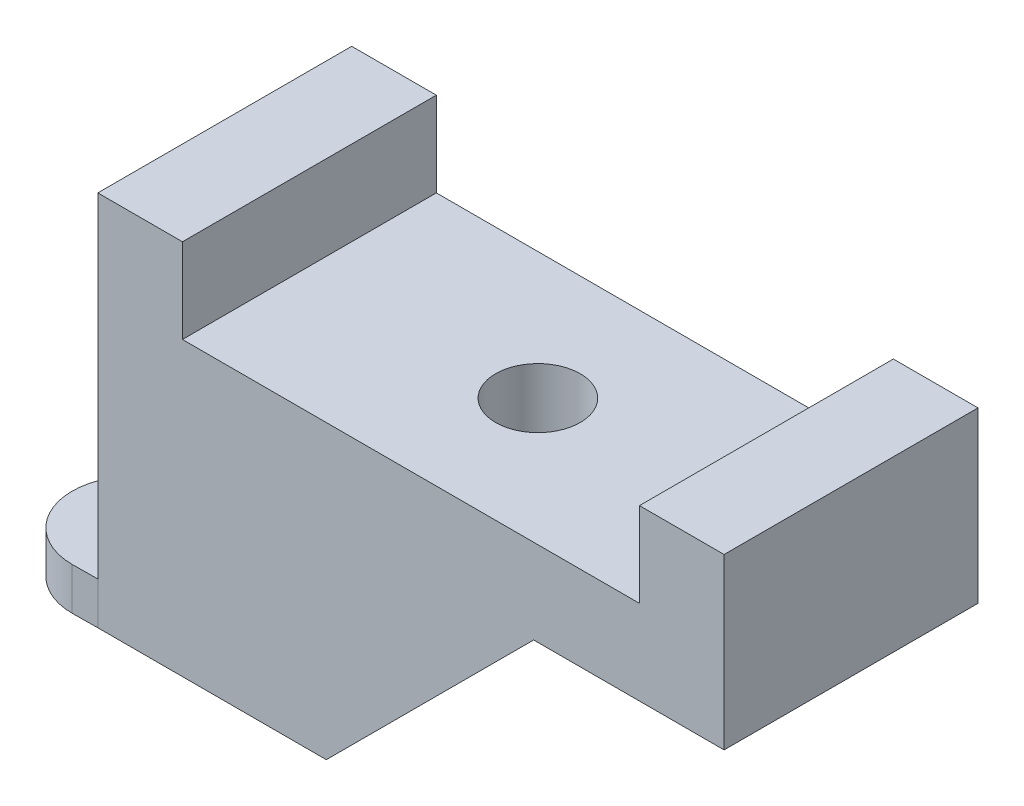
ISO-10303-21;
HEADER;
FILE_DESCRIPTION(('STEP AP214'),'2;1');
FILE_NAME('part.step','',(''),(''),'','','');
FILE_SCHEMA(('AUTOMOTIVE_DESIGN { 1 0 10303 214 1 1 1 1 }'));
ENDSEC;
DATA;
#1=APPLICATION_CONTEXT('core data for automotive mechanical design processes');
#2=APPLICATION_PROTOCOL_DEFINITION('international standard','automotive_design',2000,#1);
#3=PRODUCT_CONTEXT('',#1,'mechanical');
#4=PRODUCT('Part','Part','',(#3));
#5=PRODUCT_RELATED_PRODUCT_CATEGORY('part','',(#4));
#6=PRODUCT_DEFINITION_FORMATION('','',#4);
#7=PRODUCT_DEFINITION_CONTEXT('part definition',#1,'design');
#8=PRODUCT_DEFINITION('design','',#6,#7);
#9=PRODUCT_DEFINITION_SHAPE('','',#8);
#10=(LENGTH_UNIT() NAMED_UNIT(*) SI_UNIT(.MILLI.,.METRE.));
#11=(NAMED_UNIT(*) PLANE_ANGLE_UNIT() SI_UNIT($,.RADIAN.));
#12=(NAMED_UNIT(*) SI_UNIT($,.STERADIAN.) SOLID_ANGLE_UNIT());
#13=UNCERTAINTY_MEASURE_WITH_UNIT(LENGTH_MEASURE(1.E-05),#10,'distance_accuracy_value','');
#14=(GEOMETRIC_REPRESENTATION_CONTEXT(3) GLOBAL_UNCERTAINTY_ASSIGNED_CONTEXT((#13)) GLOBAL_UNIT_ASSIGNED_CONTEXT((#10,
#11,#12)) REPRESENTATION_CONTEXT('',''));
#15=CARTESIAN_POINT('',(0.,0.,0.));
#16=DIRECTION('',(0.,0.,1.));
#17=DIRECTION('',(1.,0.,0.));
#18=AXIS2_PLACEMENT_3D('',#15,#16,#17);
#19=CARTESIAN_POINT('',(-11.1,3.,-4.5));
#20=DIRECTION('',(1.,0.,0.));
#21=DIRECTION('',(0.,0.,-1.));
#22=AXIS2_PLACEMENT_3D('',#19,#20,#21);
#23=PLANE('',#22);
#24=DIRECTION('',(0.,-1.,0.));
#25=VECTOR('',#24,1.);
#26=CARTESIAN_POINT('',(-11.1,3.,-4.5));
#27=LINE('',#26,#25);
#28=CARTESIAN_POINT('',(-11.1,6.,-4.5));
#29=VERTEX_POINT('',#28);
#30=CARTESIAN_POINT('',(-11.1,-2.85,-4.5));
#31=VERTEX_POINT('',#30);
#32=EDGE_CURVE('E168',#29,#31,#27,.T.);
#33=ORIENTED_EDGE('',*,*,#32,.T.);
#34=DIRECTION('',(0.,0.707106781186547,-0.707106781186548));
#35=VECTOR('',#34,1.);
#36=CARTESIAN_POINT('',(-11.1,-2.85,-4.5));
#37=LINE('',#36,#35);
#38=CARTESIAN_POINT('',(-11.1,-7.35,0.));
#39=VERTEX_POINT('',#38);
#40=EDGE_CURVE('E60',#31,#39,#37,.F.);
#41=ORIENTED_EDGE('',*,*,#40,.T.);
#42=DIRECTION('',(0.,-1.,0.));
#43=VECTOR('',#42,1.);
#44=CARTESIAN_POINT('',(-11.1,-5.85,0.));
#45=LINE('',#44,#43);
#46=CARTESIAN_POINT('',(-11.1,-5.85,0.));
#47=VERTEX_POINT('',#46);
#48=EDGE_CURVE('E236',#47,#39,#45,.T.);
#49=ORIENTED_EDGE('',*,*,#48,.F.);
#50=DIRECTION('',(0.,0.,-1.));
#51=VECTOR('',#50,1.);
#52=CARTESIAN_POINT('',(-11.1,-5.85,0.));
#53=LINE('',#52,#51);
#54=CARTESIAN_POINT('',(-11.1,-5.85,4.5));
#55=VERTEX_POINT('',#54);
#56=EDGE_CURVE('E260',#55,#47,#53,.T.);
#57=ORIENTED_EDGE('',*,*,#56,.F.);
#58=DIRECTION('',(0.,-1.,0.));
#59=VECTOR('',#58,1.);
#60=CARTESIAN_POINT('',(-11.1,3.,4.5));
#61=LINE('',#60,#59);
#62=CARTESIAN_POINT('',(-11.1,6.,4.5));
#63=VERTEX_POINT('',#62);
#64=EDGE_CURVE('E171',#63,#55,#61,.T.);
#65=ORIENTED_EDGE('',*,*,#64,.F.);
#66=DIRECTION('',(0.,0.,1.));
#67=VECTOR('',#66,1.);
#68=CARTESIAN_POINT('',(-11.1,6.,-4.5));
#69=LINE('',#68,#67);
#70=EDGE_CURVE('E202',#29,#63,#69,.T.);
#71=ORIENTED_EDGE('',*,*,#70,.F.);
#72=EDGE_LOOP('',(#33,#41,#49,#57,#65,#71));
#73=FACE_BOUND('',#72,.T.);
#74=ADVANCED_FACE('F37',(#73),#23,.F.);
#75=CARTESIAN_POINT('',(0.,0.,0.));
#76=DIRECTION('',(0.,1.,0.));
#77=DIRECTION('',(0.,0.,1.));
#78=AXIS2_PLACEMENT_3D('',#75,#76,#77);
#79=PLANE('',#78);
#80=DIRECTION('',(1.,0.,0.));
#81=VECTOR('',#80,1.);
#82=CARTESIAN_POINT('',(-11.1,0.,4.5));
#83=LINE('',#82,#81);
#84=CARTESIAN_POINT('',(4.34999999999998,0.,4.5));
#85=VERTEX_POINT('',#84);
#86=CARTESIAN_POINT('',(11.1,0.,4.5));
#87=VERTEX_POINT('',#86);
#88=EDGE_CURVE('E178',#85,#87,#83,.T.);
#89=ORIENTED_EDGE('',*,*,#88,.F.);
#90=DIRECTION('',(0.,0.,-1.));
#91=VECTOR('',#90,1.);
#92=CARTESIAN_POINT('',(4.34999999999998,0.,-4.5));
#93=LINE('',#92,#91);
#94=CARTESIAN_POINT('',(4.34999999999998,0.,-4.5));
#95=VERTEX_POINT('',#94);
#96=EDGE_CURVE('E163',#85,#95,#93,.T.);
#97=ORIENTED_EDGE('',*,*,#96,.T.);
#98=DIRECTION('',(-1.,0.,0.));
#99=VECTOR('',#98,1.);
#100=CARTESIAN_POINT('',(-11.1,0.,-4.5));
#101=LINE('',#100,#99);
#102=CARTESIAN_POINT('',(11.1,0.,-4.5));
#103=VERTEX_POINT('',#102);
#104=EDGE_CURVE('E181',#103,#95,#101,.T.);
#105=ORIENTED_EDGE('',*,*,#104,.F.);
#106=DIRECTION('',(0.,0.,-1.));
#107=VECTOR('',#106,1.);
#108=CARTESIAN_POINT('',(11.1,0.,-4.5));
#109=LINE('',#108,#107);
#110=EDGE_CURVE('E184',#87,#103,#109,.T.);
#111=ORIENTED_EDGE('',*,*,#110,.F.);
#112=EDGE_LOOP('',(#89,#97,#105,#111));
#113=FACE_BOUND('',#112,.T.);
#114=ADVANCED_FACE('F282',(#113),#79,.F.);
#115=CARTESIAN_POINT('',(0.,3.,0.));
#116=DIRECTION('',(0.,1.,0.));
#117=DIRECTION('',(0.,0.,1.));
#118=AXIS2_PLACEMENT_3D('',#115,#116,#117);
#119=PLANE('',#118);
#120=CARTESIAN_POINT('',(0.,3.,0.));
#121=DIRECTION('',(0.,1.,0.));
#122=DIRECTION('',(0.,0.,1.));
#123=AXIS2_PLACEMENT_3D('',#120,#121,#122);
#124=CIRCLE('',#123,1.5);
#125=CARTESIAN_POINT('',(0.,3.,1.5));
#126=VERTEX_POINT('',#125);
#127=EDGE_CURVE('E187',#126,#126,#124,.T.);
#128=ORIENTED_EDGE('',*,*,#127,.F.);
#129=EDGE_LOOP('',(#128));
#130=FACE_BOUND('',#129,.T.);
#131=DIRECTION('',(1.,0.,0.));
#132=VECTOR('',#131,1.);
#133=CARTESIAN_POINT('',(-11.1,3.,4.5));
#134=LINE('',#133,#132);
#135=CARTESIAN_POINT('',(-8.1,3.,4.5));
#136=VERTEX_POINT('',#135);
#137=CARTESIAN_POINT('',(8.1,3.,4.5));
#138=VERTEX_POINT('',#137);
#139=EDGE_CURVE('E177',#136,#138,#134,.T.);
#140=ORIENTED_EDGE('',*,*,#139,.T.);
#141=DIRECTION('',(0.,0.,1.));
#142=VECTOR('',#141,1.);
#143=CARTESIAN_POINT('',(8.1,3.,4.5));
#144=LINE('',#143,#142);
#145=CARTESIAN_POINT('',(8.1,3.,-4.5));
#146=VERTEX_POINT('',#145);
#147=EDGE_CURVE('E218',#146,#138,#144,.T.);
#148=ORIENTED_EDGE('',*,*,#147,.F.);
#149=DIRECTION('',(-1.,0.,0.));
#150=VECTOR('',#149,1.);
#151=CARTESIAN_POINT('',(-11.1,3.,-4.5));
#152=LINE('',#151,#150);
#153=CARTESIAN_POINT('',(-8.1,3.,-4.5));
#154=VERTEX_POINT('',#153);
#155=EDGE_CURVE('E180',#146,#154,#152,.T.);
#156=ORIENTED_EDGE('',*,*,#155,.T.);
#157=DIRECTION('',(0.,0.,-1.));
#158=VECTOR('',#157,1.);
#159=CARTESIAN_POINT('',(-8.1,3.,-4.5));
#160=LINE('',#159,#158);
#161=EDGE_CURVE('E199',#136,#154,#160,.T.);
#162=ORIENTED_EDGE('',*,*,#161,.F.);
#163=EDGE_LOOP('',(#140,#148,#156,#162));
#164=FACE_BOUND('',#163,.T.);
#165=ADVANCED_FACE('F288',(#130,#164),#119,.T.);
#166=CARTESIAN_POINT('',(11.1,3.,-4.5));
#167=DIRECTION('',(-1.,0.,0.));
#168=DIRECTION('',(0.,0.,1.));
#169=AXIS2_PLACEMENT_3D('',#166,#167,#168);
#170=PLANE('',#169);
#171=ORIENTED_EDGE('',*,*,#110,.T.);
#172=DIRECTION('',(0.,-1.,0.));
#173=VECTOR('',#172,1.);
#174=CARTESIAN_POINT('',(11.1,3.,-4.5));
#175=LINE('',#174,#173);
#176=CARTESIAN_POINT('',(11.1,6.,-4.5));
#177=VERTEX_POINT('',#176);
#178=EDGE_CURVE('E165',#177,#103,#175,.T.);
#179=ORIENTED_EDGE('',*,*,#178,.F.);
#180=DIRECTION('',(0.,0.,-1.));
#181=VECTOR('',#180,1.);
#182=CARTESIAN_POINT('',(11.1,6.,4.5));
#183=LINE('',#182,#181);
#184=CARTESIAN_POINT('',(11.1,6.,4.5));
#185=VERTEX_POINT('',#184);
#186=EDGE_CURVE('E221',#185,#177,#183,.T.);
#187=ORIENTED_EDGE('',*,*,#186,.F.);
#188=DIRECTION('',(0.,-1.,0.));
#189=VECTOR('',#188,1.);
#190=CARTESIAN_POINT('',(11.1,3.,4.5));
#191=LINE('',#190,#189);
#192=EDGE_CURVE('E174',#185,#87,#191,.T.);
#193=ORIENTED_EDGE('',*,*,#192,.T.);
#194=EDGE_LOOP('',(#171,#179,#187,#193));
#195=FACE_BOUND('',#194,.T.);
#196=ADVANCED_FACE('F297',(#195),#170,.F.);
#197=CARTESIAN_POINT('',(-11.1,3.,-4.5));
#198=DIRECTION('',(0.,0.,1.));
#199=DIRECTION('',(1.,0.,0.));
#200=AXIS2_PLACEMENT_3D('',#197,#198,#199);
#201=PLANE('',#200);
#202=DIRECTION('',(0.707106781186544,0.707106781186551,0.));
#203=VECTOR('',#202,1.);
#204=CARTESIAN_POINT('',(-1.87499999999993,-6.22499999999998,-4.5));
#205=LINE('',#204,#203);
#206=CARTESIAN_POINT('',(1.50000000000002,-2.85,-4.5));
#207=VERTEX_POINT('',#206);
#208=EDGE_CURVE('E159',#95,#207,#205,.F.);
#209=ORIENTED_EDGE('',*,*,#208,.T.);
#210=DIRECTION('',(-1.,0.,0.));
#211=VECTOR('',#210,1.);
#212=CARTESIAN_POINT('',(-11.1,-2.85,-4.5));
#213=LINE('',#212,#211);
#214=EDGE_CURVE('E152',#207,#31,#213,.T.);
#215=ORIENTED_EDGE('',*,*,#214,.T.);
#216=ORIENTED_EDGE('',*,*,#32,.F.);
#217=DIRECTION('',(-1.,0.,0.));
#218=VECTOR('',#217,1.);
#219=CARTESIAN_POINT('',(-11.1,6.,-4.5));
#220=LINE('',#219,#218);
#221=CARTESIAN_POINT('',(-8.1,6.,-4.5));
#222=VERTEX_POINT('',#221);
#223=EDGE_CURVE('E198',#222,#29,#220,.T.);
#224=ORIENTED_EDGE('',*,*,#223,.F.);
#225=DIRECTION('',(0.,-1.,0.));
#226=VECTOR('',#225,1.);
#227=CARTESIAN_POINT('',(-8.1,6.,-4.5));
#228=LINE('',#227,#226);
#229=EDGE_CURVE('E195',#222,#154,#228,.T.);
#230=ORIENTED_EDGE('',*,*,#229,.T.);
#231=ORIENTED_EDGE('',*,*,#155,.F.);
#232=DIRECTION('',(0.,-1.,0.));
#233=VECTOR('',#232,1.);
#234=CARTESIAN_POINT('',(8.1,6.,-4.5));
#235=LINE('',#234,#233);
#236=CARTESIAN_POINT('',(8.1,6.,-4.5));
#237=VERTEX_POINT('',#236);
#238=EDGE_CURVE('E203',#237,#146,#235,.T.);
#239=ORIENTED_EDGE('',*,*,#238,.F.);
#240=DIRECTION('',(-1.,0.,0.));
#241=VECTOR('',#240,1.);
#242=CARTESIAN_POINT('',(11.1,6.,-4.5));
#243=LINE('',#242,#241);
#244=EDGE_CURVE('E226',#177,#237,#243,.T.);
#245=ORIENTED_EDGE('',*,*,#244,.F.);
#246=ORIENTED_EDGE('',*,*,#178,.T.);
#247=ORIENTED_EDGE('',*,*,#104,.T.);
#248=EDGE_LOOP('',(#209,#215,#216,#224,#230,#231,#239,#245,#246,#247));
#249=FACE_BOUND('',#248,.T.);
#250=ADVANCED_FACE('F294',(#249),#201,.F.);
#251=CARTESIAN_POINT('',(-11.1,3.,4.5));
#252=DIRECTION('',(0.,0.,-1.));
#253=DIRECTION('',(-1.,0.,0.));
#254=AXIS2_PLACEMENT_3D('',#251,#252,#253);
#255=PLANE('',#254);
#256=ORIENTED_EDGE('',*,*,#64,.T.);
#257=DIRECTION('',(0.,-1.,0.));
#258=VECTOR('',#257,1.);
#259=CARTESIAN_POINT('',(-11.1,-5.85,4.5));
#260=LINE('',#259,#258);
#261=CARTESIAN_POINT('',(-11.1,-7.35,4.5));
#262=VERTEX_POINT('',#261);
#263=EDGE_CURVE('E233',#55,#262,#260,.T.);
#264=ORIENTED_EDGE('',*,*,#263,.T.);
#265=DIRECTION('',(1.,0.,0.));
#266=VECTOR('',#265,1.);
#267=CARTESIAN_POINT('',(-11.1,-7.35,4.5));
#268=LINE('',#267,#266);
#269=CARTESIAN_POINT('',(-3.,-7.35,4.5));
#270=VERTEX_POINT('',#269);
#271=EDGE_CURVE('E230',#262,#270,#268,.T.);
#272=ORIENTED_EDGE('',*,*,#271,.T.);
#273=DIRECTION('',(-0.707106781186544,-0.707106781186551,0.));
#274=VECTOR('',#273,1.);
#275=CARTESIAN_POINT('',(-1.87499999999993,-6.22499999999998,4.5));
#276=LINE('',#275,#274);
#277=EDGE_CURVE('E161',#270,#85,#276,.F.);
#278=ORIENTED_EDGE('',*,*,#277,.T.);
#279=ORIENTED_EDGE('',*,*,#88,.T.);
#280=ORIENTED_EDGE('',*,*,#192,.F.);
#281=DIRECTION('',(1.,0.,0.));
#282=VECTOR('',#281,1.);
#283=CARTESIAN_POINT('',(11.1,6.,4.5));
#284=LINE('',#283,#282);
#285=CARTESIAN_POINT('',(8.1,6.,4.5));
#286=VERTEX_POINT('',#285);
#287=EDGE_CURVE('E217',#286,#185,#284,.T.);
#288=ORIENTED_EDGE('',*,*,#287,.F.);
#289=DIRECTION('',(0.,-1.,0.));
#290=VECTOR('',#289,1.);
#291=CARTESIAN_POINT('',(8.1,6.,4.5));
#292=LINE('',#291,#290);
#293=EDGE_CURVE('E214',#286,#138,#292,.T.);
#294=ORIENTED_EDGE('',*,*,#293,.T.);
#295=ORIENTED_EDGE('',*,*,#139,.F.);
#296=DIRECTION('',(0.,-1.,0.));
#297=VECTOR('',#296,1.);
#298=CARTESIAN_POINT('',(-8.1,6.,4.5));
#299=LINE('',#298,#297);
#300=CARTESIAN_POINT('',(-8.1,6.,4.5));
#301=VERTEX_POINT('',#300);
#302=EDGE_CURVE('E192',#301,#136,#299,.T.);
#303=ORIENTED_EDGE('',*,*,#302,.F.);
#304=DIRECTION('',(1.,0.,0.));
#305=VECTOR('',#304,1.);
#306=CARTESIAN_POINT('',(-11.1,6.,4.5));
#307=LINE('',#306,#305);
#308=EDGE_CURVE('E208',#63,#301,#307,.T.);
#309=ORIENTED_EDGE('',*,*,#308,.F.);
#310=EDGE_LOOP('',(#256,#264,#272,#278,#279,#280,#288,#294,#295,#303,#309));
#311=FACE_BOUND('',#310,.T.);
#312=ADVANCED_FACE('F293',(#311),#255,.F.);
#313=CARTESIAN_POINT('',(0.,3.,0.));
#314=DIRECTION('',(0.,-1.,0.));
#315=DIRECTION('',(0.,0.,-1.));
#316=AXIS2_PLACEMENT_3D('',#313,#314,#315);
#317=CYLINDRICAL_SURFACE('',#316,1.5);
#318=CARTESIAN_POINT('',(0.,0.,0.));
#319=DIRECTION('',(0.,1.,0.));
#320=DIRECTION('',(0.,0.,1.));
#321=AXIS2_PLACEMENT_3D('',#318,#319,#320);
#322=CIRCLE('',#321,1.5);
#323=CARTESIAN_POINT('',(0.,0.,1.5));
#324=VERTEX_POINT('',#323);
#325=EDGE_CURVE('E42',#324,#324,#322,.T.);
#326=ORIENTED_EDGE('',*,*,#325,.F.);
#327=EDGE_LOOP('',(#326));
#328=FACE_BOUND('',#327,.T.);
#329=ORIENTED_EDGE('',*,*,#127,.T.);
#330=EDGE_LOOP('',(#329));
#331=FACE_BOUND('',#330,.T.);
#332=ADVANCED_FACE('F352',(#328,#331),#317,.F.);
#333=CARTESIAN_POINT('',(-8.1,6.,-4.5));
#334=DIRECTION('',(-1.,0.,0.));
#335=DIRECTION('',(0.,0.,1.));
#336=AXIS2_PLACEMENT_3D('',#333,#334,#335);
#337=PLANE('',#336);
#338=ORIENTED_EDGE('',*,*,#161,.T.);
#339=ORIENTED_EDGE('',*,*,#229,.F.);
#340=DIRECTION('',(0.,0.,-1.));
#341=VECTOR('',#340,1.);
#342=CARTESIAN_POINT('',(-8.1,6.,-4.5));
#343=LINE('',#342,#341);
#344=EDGE_CURVE('E206',#301,#222,#343,.T.);
#345=ORIENTED_EDGE('',*,*,#344,.F.);
#346=ORIENTED_EDGE('',*,*,#302,.T.);
#347=EDGE_LOOP('',(#338,#339,#345,#346));
#348=FACE_BOUND('',#347,.T.);
#349=ADVANCED_FACE('F348',(#348),#337,.F.);
#350=CARTESIAN_POINT('',(0.,6.,0.));
#351=DIRECTION('',(0.,1.,0.));
#352=DIRECTION('',(0.,0.,1.));
#353=AXIS2_PLACEMENT_3D('',#350,#351,#352);
#354=PLANE('',#353);
#355=ORIENTED_EDGE('',*,*,#70,.T.);
#356=ORIENTED_EDGE('',*,*,#308,.T.);
#357=ORIENTED_EDGE('',*,*,#344,.T.);
#358=ORIENTED_EDGE('',*,*,#223,.T.);
#359=EDGE_LOOP('',(#355,#356,#357,#358));
#360=FACE_BOUND('',#359,.T.);
#361=ADVANCED_FACE('F344',(#360),#354,.T.);
#362=CARTESIAN_POINT('',(8.1,6.,4.5));
#363=DIRECTION('',(1.,0.,0.));
#364=DIRECTION('',(0.,0.,-1.));
#365=AXIS2_PLACEMENT_3D('',#362,#363,#364);
#366=PLANE('',#365);
#367=ORIENTED_EDGE('',*,*,#147,.T.);
#368=ORIENTED_EDGE('',*,*,#293,.F.);
#369=DIRECTION('',(0.,0.,1.));
#370=VECTOR('',#369,1.);
#371=CARTESIAN_POINT('',(8.1,6.,4.5));
#372=LINE('',#371,#370);
#373=EDGE_CURVE('E224',#237,#286,#372,.T.);
#374=ORIENTED_EDGE('',*,*,#373,.F.);
#375=ORIENTED_EDGE('',*,*,#238,.T.);
#376=EDGE_LOOP('',(#367,#368,#374,#375));
#377=FACE_BOUND('',#376,.T.);
#378=ADVANCED_FACE('F340',(#377),#366,.F.);
#379=CARTESIAN_POINT('',(0.,6.,0.));
#380=DIRECTION('',(0.,1.,0.));
#381=DIRECTION('',(0.,0.,1.));
#382=AXIS2_PLACEMENT_3D('',#379,#380,#381);
#383=PLANE('',#382);
#384=ORIENTED_EDGE('',*,*,#186,.T.);
#385=ORIENTED_EDGE('',*,*,#244,.T.);
#386=ORIENTED_EDGE('',*,*,#373,.T.);
#387=ORIENTED_EDGE('',*,*,#287,.T.);
#388=EDGE_LOOP('',(#384,#385,#386,#387));
#389=FACE_BOUND('',#388,.T.);
#390=ADVANCED_FACE('F336',(#389),#383,.T.);
#391=CARTESIAN_POINT('',(0.,-7.35,0.));
#392=DIRECTION('',(0.,1.,0.));
#393=DIRECTION('',(0.,0.,1.));
#394=AXIS2_PLACEMENT_3D('',#391,#392,#393);
#395=PLANE('',#394);
#396=DIRECTION('',(-0.999938277319943,0.,0.011110425303554));
#397=VECTOR('',#396,1.);
#398=CARTESIAN_POINT('',(-0.00137020120972698,-7.35,-0.123318108875438));
#399=LINE('',#398,#397);
#400=CARTESIAN_POINT('',(-12.,-7.35,0.00999999999999829));
#401=VERTEX_POINT('',#400);
#402=EDGE_CURVE('E249',#39,#401,#399,.T.);
#403=ORIENTED_EDGE('',*,*,#402,.F.);
#404=DIRECTION('',(1.,0.,0.));
#405=VECTOR('',#404,1.);
#406=CARTESIAN_POINT('',(0.,-7.35,0.));
#407=LINE('',#406,#405);
#408=CARTESIAN_POINT('',(-3.,-7.35,0.));
#409=VERTEX_POINT('',#408);
#410=EDGE_CURVE('E153',#39,#409,#407,.T.);
#411=ORIENTED_EDGE('',*,*,#410,.T.);
#412=DIRECTION('',(0.,0.,-1.));
#413=VECTOR('',#412,1.);
#414=CARTESIAN_POINT('',(-3.,-7.35,4.5));
#415=LINE('',#414,#413);
#416=EDGE_CURVE('E149',#270,#409,#415,.T.);
#417=ORIENTED_EDGE('',*,*,#416,.F.);
#418=ORIENTED_EDGE('',*,*,#271,.F.);
#419=DIRECTION('',(0.999938277319943,0.,-0.0111104253035555));
#420=VECTOR('',#419,1.);
#421=CARTESIAN_POINT('',(0.0486236267127538,-7.35,4.37612640414763));
#422=LINE('',#421,#420);
#423=CARTESIAN_POINT('',(-12.,-7.35,4.51));
#424=VERTEX_POINT('',#423);
#425=EDGE_CURVE('E251',#424,#262,#422,.T.);
#426=ORIENTED_EDGE('',*,*,#425,.F.);
#427=CARTESIAN_POINT('',(-12.,-7.35,2.26));
#428=DIRECTION('',(0.,1.,0.));
#429=DIRECTION('',(0.,0.,1.));
#430=AXIS2_PLACEMENT_3D('',#427,#428,#429);
#431=CIRCLE('',#430,2.25);
#432=EDGE_CURVE('E246',#401,#424,#431,.T.);
#433=ORIENTED_EDGE('',*,*,#432,.F.);
#434=EDGE_LOOP('',(#403,#411,#417,#418,#426,#433));
#435=FACE_BOUND('',#434,.T.);
#436=CARTESIAN_POINT('',(-12.,-7.35,2.26));
#437=DIRECTION('',(0.,1.,0.));
#438=DIRECTION('',(0.,0.,1.));
#439=AXIS2_PLACEMENT_3D('',#436,#437,#438);
#440=CIRCLE('',#439,0.75);
#441=CARTESIAN_POINT('',(-12.,-7.35,3.01));
#442=VERTEX_POINT('',#441);
#443=EDGE_CURVE('E254',#442,#442,#440,.T.);
#444=ORIENTED_EDGE('',*,*,#443,.T.);
#445=EDGE_LOOP('',(#444));
#446=FACE_BOUND('',#445,.T.);
#447=ADVANCED_FACE('F329',(#435,#446),#395,.F.);
#448=CARTESIAN_POINT('',(0.0486236267127538,-5.85,4.37612640414763));
#449=DIRECTION('',(-0.0111104253035555,0.,-0.999938277319942));
#450=DIRECTION('',(-0.999938277319943,0.,0.0111104253035555));
#451=AXIS2_PLACEMENT_3D('',#448,#449,#450);
#452=PLANE('',#451);
#453=ORIENTED_EDGE('',*,*,#425,.T.);
#454=ORIENTED_EDGE('',*,*,#263,.F.);
#455=DIRECTION('',(0.999938277319943,0.,-0.0111104253035555));
#456=VECTOR('',#455,1.);
#457=CARTESIAN_POINT('',(0.0486236267127538,-5.85,4.37612640414763));
#458=LINE('',#457,#456);
#459=CARTESIAN_POINT('',(-12.,-5.85,4.51));
#460=VERTEX_POINT('',#459);
#461=EDGE_CURVE('E263',#460,#55,#458,.T.);
#462=ORIENTED_EDGE('',*,*,#461,.F.);
#463=DIRECTION('',(0.,-1.,0.));
#464=VECTOR('',#463,1.);
#465=CARTESIAN_POINT('',(-12.,-5.85,4.51));
#466=LINE('',#465,#464);
#467=EDGE_CURVE('E242',#460,#424,#466,.T.);
#468=ORIENTED_EDGE('',*,*,#467,.T.);
#469=EDGE_LOOP('',(#453,#454,#462,#468));
#470=FACE_BOUND('',#469,.T.);
#471=ADVANCED_FACE('F325',(#470),#452,.F.);
#472=CARTESIAN_POINT('',(-0.00137020120972698,-5.85,-0.123318108875438));
#473=DIRECTION('',(0.011110425303554,0.,0.999938277319942));
#474=DIRECTION('',(0.999938277319943,0.,-0.011110425303554));
#475=AXIS2_PLACEMENT_3D('',#472,#473,#474);
#476=PLANE('',#475);
#477=ORIENTED_EDGE('',*,*,#402,.T.);
#478=DIRECTION('',(0.,-1.,0.));
#479=VECTOR('',#478,1.);
#480=CARTESIAN_POINT('',(-12.,-5.85,0.00999999999999829));
#481=LINE('',#480,#479);
#482=CARTESIAN_POINT('',(-12.,-5.85,0.00999999999999829));
#483=VERTEX_POINT('',#482);
#484=EDGE_CURVE('E239',#483,#401,#481,.T.);
#485=ORIENTED_EDGE('',*,*,#484,.F.);
#486=DIRECTION('',(-0.999938277319943,0.,0.011110425303554));
#487=VECTOR('',#486,1.);
#488=CARTESIAN_POINT('',(-0.00137020120972698,-5.85,-0.123318108875438));
#489=LINE('',#488,#487);
#490=EDGE_CURVE('E258',#47,#483,#489,.T.);
#491=ORIENTED_EDGE('',*,*,#490,.F.);
#492=ORIENTED_EDGE('',*,*,#48,.T.);
#493=EDGE_LOOP('',(#477,#485,#491,#492));
#494=FACE_BOUND('',#493,.T.);
#495=ADVANCED_FACE('F322',(#494),#476,.F.);
#496=CARTESIAN_POINT('',(-12.,-5.85,2.26));
#497=DIRECTION('',(0.,-1.,0.));
#498=DIRECTION('',(0.,0.,-1.));
#499=AXIS2_PLACEMENT_3D('',#496,#497,#498);
#500=CYLINDRICAL_SURFACE('',#499,0.75);
#501=CARTESIAN_POINT('',(-12.,-5.85,2.26));
#502=DIRECTION('',(0.,1.,0.));
#503=DIRECTION('',(0.,0.,1.));
#504=AXIS2_PLACEMENT_3D('',#501,#502,#503);
#505=CIRCLE('',#504,0.75);
#506=CARTESIAN_POINT('',(-12.,-5.85,3.01));
#507=VERTEX_POINT('',#506);
#508=EDGE_CURVE('E248',#507,#507,#505,.T.);
#509=ORIENTED_EDGE('',*,*,#508,.T.);
#510=EDGE_LOOP('',(#509));
#511=FACE_BOUND('',#510,.T.);
#512=ORIENTED_EDGE('',*,*,#443,.F.);
#513=EDGE_LOOP('',(#512));
#514=FACE_BOUND('',#513,.T.);
#515=ADVANCED_FACE('F316',(#511,#514),#500,.F.);
#516=CARTESIAN_POINT('',(-12.,-5.85,2.26));
#517=DIRECTION('',(0.,-1.,0.));
#518=DIRECTION('',(0.,0.,-1.));
#519=AXIS2_PLACEMENT_3D('',#516,#517,#518);
#520=CYLINDRICAL_SURFACE('',#519,2.25);
#521=ORIENTED_EDGE('',*,*,#432,.T.);
#522=ORIENTED_EDGE('',*,*,#467,.F.);
#523=CARTESIAN_POINT('',(-12.,-5.85,2.26));
#524=DIRECTION('',(0.,1.,0.));
#525=DIRECTION('',(0.,0.,1.));
#526=AXIS2_PLACEMENT_3D('',#523,#524,#525);
#527=CIRCLE('',#526,2.25);
#528=EDGE_CURVE('E245',#483,#460,#527,.T.);
#529=ORIENTED_EDGE('',*,*,#528,.F.);
#530=ORIENTED_EDGE('',*,*,#484,.T.);
#531=EDGE_LOOP('',(#521,#522,#529,#530));
#532=FACE_BOUND('',#531,.T.);
#533=ADVANCED_FACE('F310',(#532),#520,.T.);
#534=CARTESIAN_POINT('',(0.,-5.85,0.));
#535=DIRECTION('',(0.,1.,0.));
#536=DIRECTION('',(0.,0.,1.));
#537=AXIS2_PLACEMENT_3D('',#534,#535,#536);
#538=PLANE('',#537);
#539=ORIENTED_EDGE('',*,*,#508,.F.);
#540=EDGE_LOOP('',(#539));
#541=FACE_BOUND('',#540,.T.);
#542=ORIENTED_EDGE('',*,*,#461,.T.);
#543=ORIENTED_EDGE('',*,*,#56,.T.);
#544=ORIENTED_EDGE('',*,*,#490,.T.);
#545=ORIENTED_EDGE('',*,*,#528,.T.);
#546=EDGE_LOOP('',(#542,#543,#544,#545));
#547=FACE_BOUND('',#546,.T.);
#548=ADVANCED_FACE('F305',(#541,#547),#538,.T.);
#549=CARTESIAN_POINT('',(-3.,-7.35000000000005,4.5));
#550=DIRECTION('',(0.707106781186551,-0.707106781186544,0.));
#551=DIRECTION('',(0.,0.,-1.));
#552=AXIS2_PLACEMENT_3D('',#549,#550,#551);
#553=PLANE('',#552);
#554=ORIENTED_EDGE('',*,*,#416,.T.);
#555=CARTESIAN_POINT('',(0.,-4.35000000000002,0.));
#556=DIRECTION('',(0.707106781186551,-0.707106781186544,0.));
#557=DIRECTION('',(0.707106781186544,0.707106781186551,0.));
#558=AXIS2_PLACEMENT_3D('',#555,#556,#557);
#559=ELLIPSE('',#558,4.24264068711931,3.);
#560=CARTESIAN_POINT('',(0.,-4.35,-3.));
#561=VERTEX_POINT('',#560);
#562=EDGE_CURVE('E52',#409,#561,#559,.F.);
#563=ORIENTED_EDGE('',*,*,#562,.T.);
#564=DIRECTION('',(0.577350269189622,0.577350269189628,-0.577350269189628));
#565=VECTOR('',#564,1.);
#566=CARTESIAN_POINT('',(-2.69999999999994,-7.04999999999999,-0.300000000000009));
#567=LINE('',#566,#565);
#568=EDGE_CURVE('E47',#561,#207,#567,.T.);
#569=ORIENTED_EDGE('',*,*,#568,.T.);
#570=ORIENTED_EDGE('',*,*,#208,.F.);
#571=ORIENTED_EDGE('',*,*,#96,.F.);
#572=ORIENTED_EDGE('',*,*,#277,.F.);
#573=EDGE_LOOP('',(#554,#563,#569,#570,#571,#572));
#574=FACE_BOUND('',#573,.T.);
#575=ADVANCED_FACE('F145',(#574),#553,.T.);
#576=CARTESIAN_POINT('',(-11.1,-2.85,-4.5));
#577=DIRECTION('',(0.,0.707106781186548,0.707106781186547));
#578=DIRECTION('',(-1.,0.,0.));
#579=AXIS2_PLACEMENT_3D('',#576,#577,#578);
#580=PLANE('',#579);
#581=CARTESIAN_POINT('',(0.,-7.35,0.));
#582=DIRECTION('',(0.,0.707106781186548,0.707106781186547));
#583=DIRECTION('',(0.,0.707106781186547,-0.707106781186548));
#584=AXIS2_PLACEMENT_3D('',#581,#582,#583);
#585=ELLIPSE('',#584,4.24264068711928,3.);
#586=EDGE_CURVE('E11',#409,#561,#585,.F.);
#587=ORIENTED_EDGE('',*,*,#586,.F.);
#588=ORIENTED_EDGE('',*,*,#410,.F.);
#589=ORIENTED_EDGE('',*,*,#40,.F.);
#590=ORIENTED_EDGE('',*,*,#214,.F.);
#591=ORIENTED_EDGE('',*,*,#568,.F.);
#592=EDGE_LOOP('',(#587,#588,#589,#590,#591));
#593=FACE_BOUND('',#592,.T.);
#594=ADVANCED_FACE('F40',(#593),#580,.F.);
#595=CARTESIAN_POINT('',(0.,-7.35,0.));
#596=DIRECTION('',(0.,1.,0.));
#597=DIRECTION('',(0.,0.,1.));
#598=AXIS2_PLACEMENT_3D('',#595,#596,#597);
#599=CYLINDRICAL_SURFACE('',#598,3.);
#600=CARTESIAN_POINT('',(0.,0.,0.));
#601=DIRECTION('',(0.,1.,0.));
#602=DIRECTION('',(0.,0.,1.));
#603=AXIS2_PLACEMENT_3D('',#600,#601,#602);
#604=CIRCLE('',#603,3.);
#605=CARTESIAN_POINT('',(0.,0.,3.));
#606=VERTEX_POINT('',#605);
#607=EDGE_CURVE('E150',#606,#606,#604,.T.);
#608=ORIENTED_EDGE('',*,*,#607,.T.);
#609=EDGE_LOOP('',(#608));
#610=FACE_BOUND('',#609,.T.);
#611=ORIENTED_EDGE('',*,*,#586,.T.);
#612=ORIENTED_EDGE('',*,*,#562,.F.);
#613=EDGE_LOOP('',(#611,#612));
#614=FACE_BOUND('',#613,.T.);
#615=ADVANCED_FACE('F140',(#610,#614),#599,.F.);
#616=CARTESIAN_POINT('',(0.,0.,0.));
#617=DIRECTION('',(0.,1.,0.));
#618=DIRECTION('',(0.,0.,1.));
#619=AXIS2_PLACEMENT_3D('',#616,#617,#618);
#620=PLANE('',#619);
#621=ORIENTED_EDGE('',*,*,#325,.T.);
#622=EDGE_LOOP('',(#621));
#623=FACE_BOUND('',#622,.T.);
#624=ORIENTED_EDGE('',*,*,#607,.F.);
#625=EDGE_LOOP('',(#624));
#626=FACE_BOUND('',#625,.T.);
#627=ADVANCED_FACE('F272',(#623,#626),#620,.F.);
#628=CLOSED_SHELL('',(#74,#114,#165,#196,#250,#312,#332,#349,#361,#378,#390,#447,#471,#495,#515,
#533,#548,#575,#594,#615,#627));
#629=MANIFOLD_SOLID_BREP('B2',#628);
#630=ADVANCED_BREP_SHAPE_REPRESENTATION('',(#18,#629),#14);
#631=SHAPE_DEFINITION_REPRESENTATION(#9,#630);
ENDSEC;
END-ISO-10303-21;
